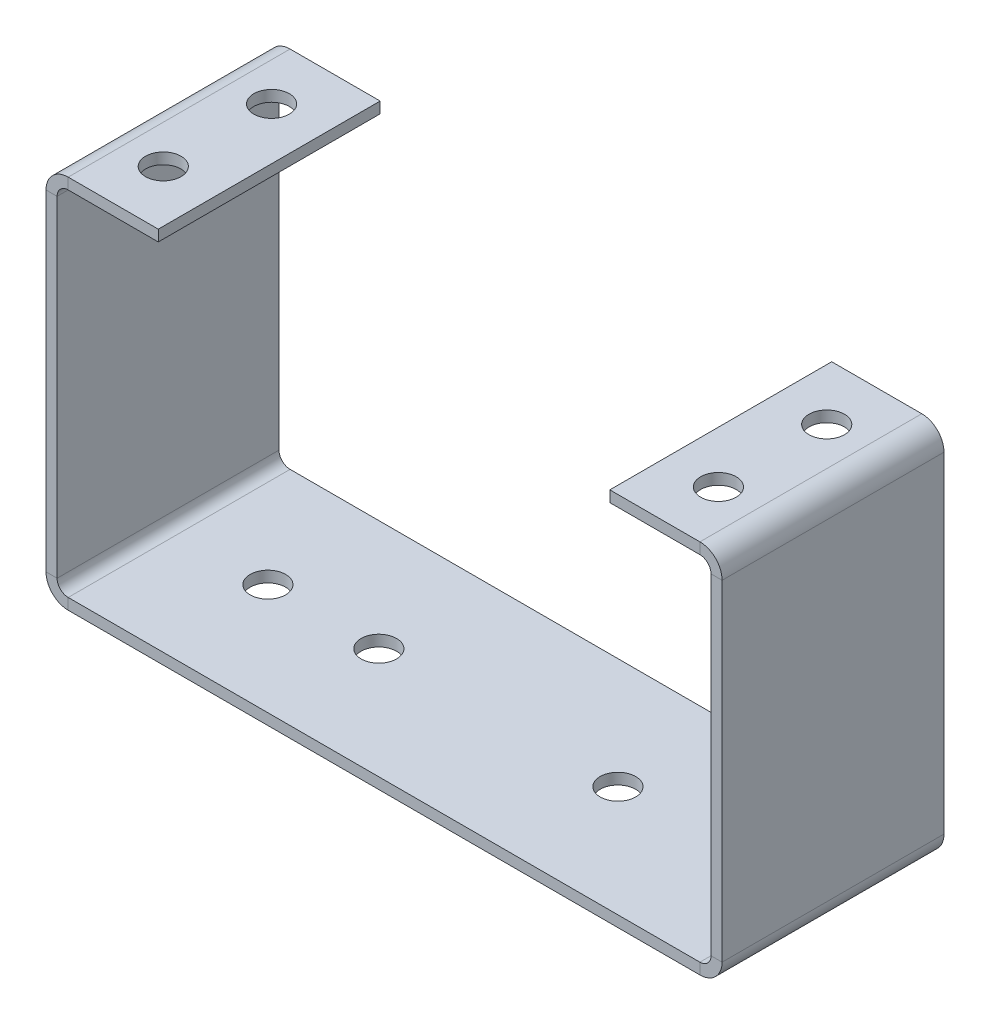
ISO-10303-21;
HEADER;
FILE_DESCRIPTION(('STEP AP214'),'2;1');
FILE_NAME('part.step','',(''),(''),'','','');
FILE_SCHEMA(('AUTOMOTIVE_DESIGN { 1 0 10303 214 1 1 1 1 }'));
ENDSEC;
DATA;
#1=APPLICATION_CONTEXT('core data for automotive mechanical design processes');
#2=APPLICATION_PROTOCOL_DEFINITION('international standard','automotive_design',2000,#1);
#3=PRODUCT_CONTEXT('',#1,'mechanical');
#4=PRODUCT('Part','Part','',(#3));
#5=PRODUCT_RELATED_PRODUCT_CATEGORY('part','',(#4));
#6=PRODUCT_DEFINITION_FORMATION('','',#4);
#7=PRODUCT_DEFINITION_CONTEXT('part definition',#1,'design');
#8=PRODUCT_DEFINITION('design','',#6,#7);
#9=PRODUCT_DEFINITION_SHAPE('','',#8);
#10=(LENGTH_UNIT() NAMED_UNIT(*) SI_UNIT(.MILLI.,.METRE.));
#11=(NAMED_UNIT(*) PLANE_ANGLE_UNIT() SI_UNIT($,.RADIAN.));
#12=(NAMED_UNIT(*) SI_UNIT($,.STERADIAN.) SOLID_ANGLE_UNIT());
#13=UNCERTAINTY_MEASURE_WITH_UNIT(LENGTH_MEASURE(1.E-05),#10,'distance_accuracy_value','');
#14=(GEOMETRIC_REPRESENTATION_CONTEXT(3) GLOBAL_UNCERTAINTY_ASSIGNED_CONTEXT((#13)) GLOBAL_UNIT_ASSIGNED_CONTEXT((#10,
#11,#12)) REPRESENTATION_CONTEXT('',''));
#15=CARTESIAN_POINT('',(0.,0.,0.));
#16=DIRECTION('',(0.,0.,1.));
#17=DIRECTION('',(1.,0.,0.));
#18=AXIS2_PLACEMENT_3D('',#15,#16,#17);
#19=CARTESIAN_POINT('',(5.44999999999998,32.81,-5.11999999999999));
#20=DIRECTION('',(0.,1.,0.));
#21=DIRECTION('',(0.,0.,1.));
#22=AXIS2_PLACEMENT_3D('',#19,#20,#21);
#23=CYLINDRICAL_SURFACE('',#22,1.6);
#24=CARTESIAN_POINT('',(5.44999999999998,32.81,-5.11999999999999));
#25=DIRECTION('',(0.,1.,0.));
#26=DIRECTION('',(0.,0.,1.));
#27=AXIS2_PLACEMENT_3D('',#24,#25,#26);
#28=CIRCLE('',#27,1.6);
#29=CARTESIAN_POINT('',(5.44999999999998,32.81,-3.52));
#30=VERTEX_POINT('',#29);
#31=EDGE_CURVE('E274',#30,#30,#28,.T.);
#32=ORIENTED_EDGE('',*,*,#31,.F.);
#33=EDGE_LOOP('',(#32));
#34=FACE_BOUND('',#33,.T.);
#35=CARTESIAN_POINT('',(5.44999999999998,33.81,-5.11999999999999));
#36=DIRECTION('',(0.,1.,0.));
#37=DIRECTION('',(0.,0.,1.));
#38=AXIS2_PLACEMENT_3D('',#35,#36,#37);
#39=CIRCLE('',#38,1.6);
#40=CARTESIAN_POINT('',(5.44999999999998,33.81,-3.52));
#41=VERTEX_POINT('',#40);
#42=EDGE_CURVE('E302',#41,#41,#39,.T.);
#43=ORIENTED_EDGE('',*,*,#42,.T.);
#44=EDGE_LOOP('',(#43));
#45=FACE_BOUND('',#44,.T.);
#46=ADVANCED_FACE('F36',(#34,#45),#23,.F.);
#47=CARTESIAN_POINT('',(5.44999999999998,32.81,-14.88));
#48=DIRECTION('',(0.,1.,0.));
#49=DIRECTION('',(0.,0.,1.));
#50=AXIS2_PLACEMENT_3D('',#47,#48,#49);
#51=CYLINDRICAL_SURFACE('',#50,1.6);
#52=CARTESIAN_POINT('',(5.44999999999998,32.81,-14.88));
#53=DIRECTION('',(0.,1.,0.));
#54=DIRECTION('',(0.,0.,1.));
#55=AXIS2_PLACEMENT_3D('',#52,#53,#54);
#56=CIRCLE('',#55,1.6);
#57=CARTESIAN_POINT('',(5.44999999999998,32.81,-13.28));
#58=VERTEX_POINT('',#57);
#59=EDGE_CURVE('E277',#58,#58,#56,.T.);
#60=ORIENTED_EDGE('',*,*,#59,.F.);
#61=EDGE_LOOP('',(#60));
#62=FACE_BOUND('',#61,.T.);
#63=CARTESIAN_POINT('',(5.44999999999998,33.81,-14.88));
#64=DIRECTION('',(0.,1.,0.));
#65=DIRECTION('',(0.,0.,1.));
#66=AXIS2_PLACEMENT_3D('',#63,#64,#65);
#67=CIRCLE('',#66,1.6);
#68=CARTESIAN_POINT('',(5.44999999999998,33.81,-13.28));
#69=VERTEX_POINT('',#68);
#70=EDGE_CURVE('E299',#69,#69,#67,.T.);
#71=ORIENTED_EDGE('',*,*,#70,.T.);
#72=EDGE_LOOP('',(#71));
#73=FACE_BOUND('',#72,.T.);
#74=ADVANCED_FACE('F463',(#62,#73),#51,.F.);
#75=CARTESIAN_POINT('',(10.12,-10.361027321573,0.));
#76=DIRECTION('',(1.,0.,0.));
#77=DIRECTION('',(0.,1.,0.));
#78=AXIS2_PLACEMENT_3D('',#75,#76,#77);
#79=PLANE('',#78);
#80=DIRECTION('',(0.,1.,0.));
#81=VECTOR('',#80,1.);
#82=CARTESIAN_POINT('',(10.12,-10.361027321573,-20.));
#83=LINE('',#82,#81);
#84=CARTESIAN_POINT('',(10.12,32.81,-20.));
#85=VERTEX_POINT('',#84);
#86=CARTESIAN_POINT('',(10.12,33.81,-20.));
#87=VERTEX_POINT('',#86);
#88=EDGE_CURVE('E296',#85,#87,#83,.T.);
#89=ORIENTED_EDGE('',*,*,#88,.T.);
#90=DIRECTION('',(0.,0.,1.));
#91=VECTOR('',#90,1.);
#92=CARTESIAN_POINT('',(10.12,33.81,0.));
#93=LINE('',#92,#91);
#94=CARTESIAN_POINT('',(10.12,33.81,0.));
#95=VERTEX_POINT('',#94);
#96=EDGE_CURVE('E293',#87,#95,#93,.T.);
#97=ORIENTED_EDGE('',*,*,#96,.T.);
#98=DIRECTION('',(0.,1.,0.));
#99=VECTOR('',#98,1.);
#100=CARTESIAN_POINT('',(10.12,-10.361027321573,0.));
#101=LINE('',#100,#99);
#102=CARTESIAN_POINT('',(10.12,32.81,0.));
#103=VERTEX_POINT('',#102);
#104=EDGE_CURVE('E280',#103,#95,#101,.T.);
#105=ORIENTED_EDGE('',*,*,#104,.F.);
#106=DIRECTION('',(0.,0.,-1.));
#107=VECTOR('',#106,1.);
#108=CARTESIAN_POINT('',(10.12,32.81,0.));
#109=LINE('',#108,#107);
#110=EDGE_CURVE('E55',#103,#85,#109,.T.);
#111=ORIENTED_EDGE('',*,*,#110,.T.);
#112=EDGE_LOOP('',(#89,#97,#105,#111));
#113=FACE_BOUND('',#112,.T.);
#114=ADVANCED_FACE('F469',(#113),#79,.T.);
#115=CARTESIAN_POINT('',(10.12,-10.361027321573,-20.));
#116=DIRECTION('',(0.,0.,-1.));
#117=DIRECTION('',(1.,0.,0.));
#118=AXIS2_PLACEMENT_3D('',#115,#116,#117);
#119=PLANE('',#118);
#120=DIRECTION('',(0.,1.,0.));
#121=VECTOR('',#120,1.);
#122=CARTESIAN_POINT('',(1.99999999999998,-10.361027321573,-20.));
#123=LINE('',#122,#121);
#124=CARTESIAN_POINT('',(1.99999999999998,32.81,-20.));
#125=VERTEX_POINT('',#124);
#126=CARTESIAN_POINT('',(1.99999999999998,33.81,-20.));
#127=VERTEX_POINT('',#126);
#128=EDGE_CURVE('E289',#125,#127,#123,.T.);
#129=ORIENTED_EDGE('',*,*,#128,.T.);
#130=DIRECTION('',(-1.,0.,0.));
#131=VECTOR('',#130,1.);
#132=CARTESIAN_POINT('',(0.,33.81,-20.));
#133=LINE('',#132,#131);
#134=EDGE_CURVE('E282',#87,#127,#133,.T.);
#135=ORIENTED_EDGE('',*,*,#134,.F.);
#136=ORIENTED_EDGE('',*,*,#88,.F.);
#137=DIRECTION('',(-1.,0.,0.));
#138=VECTOR('',#137,1.);
#139=CARTESIAN_POINT('',(10.12,32.81,-20.));
#140=LINE('',#139,#138);
#141=EDGE_CURVE('E287',#85,#125,#140,.T.);
#142=ORIENTED_EDGE('',*,*,#141,.T.);
#143=EDGE_LOOP('',(#129,#135,#136,#142));
#144=FACE_BOUND('',#143,.T.);
#145=ADVANCED_FACE('F480',(#144),#119,.T.);
#146=CARTESIAN_POINT('',(0.,33.81,0.));
#147=DIRECTION('',(0.,1.,0.));
#148=DIRECTION('',(0.,0.,1.));
#149=AXIS2_PLACEMENT_3D('',#146,#147,#148);
#150=PLANE('',#149);
#151=DIRECTION('',(0.,0.,-1.));
#152=VECTOR('',#151,1.);
#153=CARTESIAN_POINT('',(1.99999999999999,33.81,-20.));
#154=LINE('',#153,#152);
#155=CARTESIAN_POINT('',(1.99999999999999,33.81,0.));
#156=VERTEX_POINT('',#155);
#157=EDGE_CURVE('E207',#156,#127,#154,.T.);
#158=ORIENTED_EDGE('',*,*,#157,.F.);
#159=DIRECTION('',(1.,0.,0.));
#160=VECTOR('',#159,1.);
#161=CARTESIAN_POINT('',(10.12,33.81,0.));
#162=LINE('',#161,#160);
#163=EDGE_CURVE('E284',#156,#95,#162,.T.);
#164=ORIENTED_EDGE('',*,*,#163,.T.);
#165=ORIENTED_EDGE('',*,*,#96,.F.);
#166=ORIENTED_EDGE('',*,*,#134,.T.);
#167=EDGE_LOOP('',(#158,#164,#165,#166));
#168=FACE_BOUND('',#167,.T.);
#169=ORIENTED_EDGE('',*,*,#70,.F.);
#170=EDGE_LOOP('',(#169));
#171=FACE_BOUND('',#170,.T.);
#172=ORIENTED_EDGE('',*,*,#42,.F.);
#173=EDGE_LOOP('',(#172));
#174=FACE_BOUND('',#173,.T.);
#175=ADVANCED_FACE('F484',(#168,#171,#174),#150,.T.);
#176=CARTESIAN_POINT('',(10.12,-10.361027321573,0.));
#177=DIRECTION('',(0.,0.,-1.));
#178=DIRECTION('',(1.,0.,0.));
#179=AXIS2_PLACEMENT_3D('',#176,#177,#178);
#180=PLANE('',#179);
#181=ORIENTED_EDGE('',*,*,#163,.F.);
#182=DIRECTION('',(0.,1.,0.));
#183=VECTOR('',#182,1.);
#184=CARTESIAN_POINT('',(1.99999999999998,-10.361027321573,0.));
#185=LINE('',#184,#183);
#186=CARTESIAN_POINT('',(1.99999999999999,32.81,0.));
#187=VERTEX_POINT('',#186);
#188=EDGE_CURVE('E40',#187,#156,#185,.T.);
#189=ORIENTED_EDGE('',*,*,#188,.F.);
#190=DIRECTION('',(-1.,0.,0.));
#191=VECTOR('',#190,1.);
#192=CARTESIAN_POINT('',(10.12,32.81,0.));
#193=LINE('',#192,#191);
#194=EDGE_CURVE('E46',#103,#187,#193,.T.);
#195=ORIENTED_EDGE('',*,*,#194,.F.);
#196=ORIENTED_EDGE('',*,*,#104,.T.);
#197=EDGE_LOOP('',(#181,#189,#195,#196));
#198=FACE_BOUND('',#197,.T.);
#199=ADVANCED_FACE('F487',(#198),#180,.F.);
#200=CARTESIAN_POINT('',(10.12,32.81,0.));
#201=DIRECTION('',(0.,1.,0.));
#202=DIRECTION('',(0.,0.,1.));
#203=AXIS2_PLACEMENT_3D('',#200,#201,#202);
#204=PLANE('',#203);
#205=ORIENTED_EDGE('',*,*,#59,.T.);
#206=EDGE_LOOP('',(#205));
#207=FACE_BOUND('',#206,.T.);
#208=ORIENTED_EDGE('',*,*,#31,.T.);
#209=EDGE_LOOP('',(#208));
#210=FACE_BOUND('',#209,.T.);
#211=ORIENTED_EDGE('',*,*,#194,.T.);
#212=DIRECTION('',(0.,0.,-1.));
#213=VECTOR('',#212,1.);
#214=CARTESIAN_POINT('',(1.99999999999999,32.81,-20.));
#215=LINE('',#214,#213);
#216=EDGE_CURVE('E11',#187,#125,#215,.T.);
#217=ORIENTED_EDGE('',*,*,#216,.T.);
#218=ORIENTED_EDGE('',*,*,#141,.F.);
#219=ORIENTED_EDGE('',*,*,#110,.F.);
#220=EDGE_LOOP('',(#211,#217,#218,#219));
#221=FACE_BOUND('',#220,.T.);
#222=ADVANCED_FACE('F38',(#207,#210,#221),#204,.F.);
#223=CARTESIAN_POINT('',(55.49,32.81,-5.11999999999995));
#224=DIRECTION('',(0.,1.,0.));
#225=DIRECTION('',(0.,0.,1.));
#226=AXIS2_PLACEMENT_3D('',#223,#224,#225);
#227=CYLINDRICAL_SURFACE('',#226,1.6);
#228=CARTESIAN_POINT('',(55.49,32.81,-5.11999999999995));
#229=DIRECTION('',(0.,1.,0.));
#230=DIRECTION('',(0.,0.,1.));
#231=AXIS2_PLACEMENT_3D('',#228,#229,#230);
#232=CIRCLE('',#231,1.6);
#233=CARTESIAN_POINT('',(55.49,32.81,-3.51999999999996));
#234=VERTEX_POINT('',#233);
#235=EDGE_CURVE('E238',#234,#234,#232,.T.);
#236=ORIENTED_EDGE('',*,*,#235,.F.);
#237=EDGE_LOOP('',(#236));
#238=FACE_BOUND('',#237,.T.);
#239=CARTESIAN_POINT('',(55.49,33.81,-5.11999999999995));
#240=DIRECTION('',(0.,1.,0.));
#241=DIRECTION('',(0.,0.,1.));
#242=AXIS2_PLACEMENT_3D('',#239,#240,#241);
#243=CIRCLE('',#242,1.6);
#244=CARTESIAN_POINT('',(55.49,33.81,-3.51999999999996));
#245=VERTEX_POINT('',#244);
#246=EDGE_CURVE('E266',#245,#245,#243,.T.);
#247=ORIENTED_EDGE('',*,*,#246,.T.);
#248=EDGE_LOOP('',(#247));
#249=FACE_BOUND('',#248,.T.);
#250=ADVANCED_FACE('F493',(#238,#249),#227,.F.);
#251=CARTESIAN_POINT('',(55.49,32.81,-14.88));
#252=DIRECTION('',(0.,1.,0.));
#253=DIRECTION('',(0.,0.,1.));
#254=AXIS2_PLACEMENT_3D('',#251,#252,#253);
#255=CYLINDRICAL_SURFACE('',#254,1.6);
#256=CARTESIAN_POINT('',(55.49,32.81,-14.88));
#257=DIRECTION('',(0.,1.,0.));
#258=DIRECTION('',(0.,0.,1.));
#259=AXIS2_PLACEMENT_3D('',#256,#257,#258);
#260=CIRCLE('',#259,1.6);
#261=CARTESIAN_POINT('',(55.49,32.81,-13.28));
#262=VERTEX_POINT('',#261);
#263=EDGE_CURVE('E241',#262,#262,#260,.T.);
#264=ORIENTED_EDGE('',*,*,#263,.F.);
#265=EDGE_LOOP('',(#264));
#266=FACE_BOUND('',#265,.T.);
#267=CARTESIAN_POINT('',(55.49,33.81,-14.88));
#268=DIRECTION('',(0.,1.,0.));
#269=DIRECTION('',(0.,0.,1.));
#270=AXIS2_PLACEMENT_3D('',#267,#268,#269);
#271=CIRCLE('',#270,1.6);
#272=CARTESIAN_POINT('',(55.49,33.81,-13.28));
#273=VERTEX_POINT('',#272);
#274=EDGE_CURVE('E263',#273,#273,#271,.T.);
#275=ORIENTED_EDGE('',*,*,#274,.T.);
#276=EDGE_LOOP('',(#275));
#277=FACE_BOUND('',#276,.T.);
#278=ADVANCED_FACE('F506',(#266,#277),#255,.F.);
#279=CARTESIAN_POINT('',(50.82,-10.361027321573,-20.));
#280=DIRECTION('',(-1.,0.,0.));
#281=DIRECTION('',(0.,-1.,0.));
#282=AXIS2_PLACEMENT_3D('',#279,#280,#281);
#283=PLANE('',#282);
#284=DIRECTION('',(0.,0.,-1.));
#285=VECTOR('',#284,1.);
#286=CARTESIAN_POINT('',(50.82,33.81,-20.));
#287=LINE('',#286,#285);
#288=CARTESIAN_POINT('',(50.82,33.81,0.));
#289=VERTEX_POINT('',#288);
#290=CARTESIAN_POINT('',(50.82,33.81,-20.));
#291=VERTEX_POINT('',#290);
#292=EDGE_CURVE('E97',#289,#291,#287,.T.);
#293=ORIENTED_EDGE('',*,*,#292,.T.);
#294=DIRECTION('',(0.,1.,0.));
#295=VECTOR('',#294,1.);
#296=CARTESIAN_POINT('',(50.82,-10.361027321573,-20.));
#297=LINE('',#296,#295);
#298=CARTESIAN_POINT('',(50.82,32.81,-20.));
#299=VERTEX_POINT('',#298);
#300=EDGE_CURVE('E245',#299,#291,#297,.T.);
#301=ORIENTED_EDGE('',*,*,#300,.F.);
#302=DIRECTION('',(0.,0.,1.));
#303=VECTOR('',#302,1.);
#304=CARTESIAN_POINT('',(50.82,32.81,-20.));
#305=LINE('',#304,#303);
#306=CARTESIAN_POINT('',(50.82,32.81,0.));
#307=VERTEX_POINT('',#306);
#308=EDGE_CURVE('E82',#299,#307,#305,.T.);
#309=ORIENTED_EDGE('',*,*,#308,.T.);
#310=DIRECTION('',(0.,1.,0.));
#311=VECTOR('',#310,1.);
#312=CARTESIAN_POINT('',(50.82,-10.361027321573,0.));
#313=LINE('',#312,#311);
#314=EDGE_CURVE('E258',#307,#289,#313,.T.);
#315=ORIENTED_EDGE('',*,*,#314,.T.);
#316=EDGE_LOOP('',(#293,#301,#309,#315));
#317=FACE_BOUND('',#316,.T.);
#318=ADVANCED_FACE('F514',(#317),#283,.T.);
#319=CARTESIAN_POINT('',(50.82,-10.361027321573,0.));
#320=DIRECTION('',(0.,0.,1.));
#321=DIRECTION('',(-1.,0.,0.));
#322=AXIS2_PLACEMENT_3D('',#319,#320,#321);
#323=PLANE('',#322);
#324=DIRECTION('',(1.,0.,0.));
#325=VECTOR('',#324,1.);
#326=CARTESIAN_POINT('',(60.94,33.81,0.));
#327=LINE('',#326,#325);
#328=CARTESIAN_POINT('',(58.94,33.81,0.));
#329=VERTEX_POINT('',#328);
#330=EDGE_CURVE('E250',#289,#329,#327,.T.);
#331=ORIENTED_EDGE('',*,*,#330,.F.);
#332=ORIENTED_EDGE('',*,*,#314,.F.);
#333=DIRECTION('',(1.,0.,0.));
#334=VECTOR('',#333,1.);
#335=CARTESIAN_POINT('',(50.82,32.81,0.));
#336=LINE('',#335,#334);
#337=CARTESIAN_POINT('',(58.94,32.81,0.));
#338=VERTEX_POINT('',#337);
#339=EDGE_CURVE('E255',#307,#338,#336,.T.);
#340=ORIENTED_EDGE('',*,*,#339,.T.);
#341=DIRECTION('',(0.,1.,0.));
#342=VECTOR('',#341,1.);
#343=CARTESIAN_POINT('',(58.94,-10.361027321573,0.));
#344=LINE('',#343,#342);
#345=EDGE_CURVE('E252',#338,#329,#344,.T.);
#346=ORIENTED_EDGE('',*,*,#345,.T.);
#347=EDGE_LOOP('',(#331,#332,#340,#346));
#348=FACE_BOUND('',#347,.T.);
#349=ADVANCED_FACE('F524',(#348),#323,.T.);
#350=CARTESIAN_POINT('',(0.,33.81,0.));
#351=DIRECTION('',(0.,-1.,0.));
#352=DIRECTION('',(0.,0.,-1.));
#353=AXIS2_PLACEMENT_3D('',#350,#351,#352);
#354=PLANE('',#353);
#355=ORIENTED_EDGE('',*,*,#274,.F.);
#356=EDGE_LOOP('',(#355));
#357=FACE_BOUND('',#356,.T.);
#358=ORIENTED_EDGE('',*,*,#246,.F.);
#359=EDGE_LOOP('',(#358));
#360=FACE_BOUND('',#359,.T.);
#361=ORIENTED_EDGE('',*,*,#330,.T.);
#362=DIRECTION('',(0.,0.,-1.));
#363=VECTOR('',#362,1.);
#364=CARTESIAN_POINT('',(58.94,33.81,0.));
#365=LINE('',#364,#363);
#366=CARTESIAN_POINT('',(58.94,33.81,-20.));
#367=VERTEX_POINT('',#366);
#368=EDGE_CURVE('E248',#329,#367,#365,.T.);
#369=ORIENTED_EDGE('',*,*,#368,.T.);
#370=DIRECTION('',(1.,0.,0.));
#371=VECTOR('',#370,1.);
#372=CARTESIAN_POINT('',(50.82,33.81,-20.));
#373=LINE('',#372,#371);
#374=EDGE_CURVE('E102',#291,#367,#373,.T.);
#375=ORIENTED_EDGE('',*,*,#374,.F.);
#376=ORIENTED_EDGE('',*,*,#292,.F.);
#377=EDGE_LOOP('',(#361,#369,#375,#376));
#378=FACE_BOUND('',#377,.T.);
#379=ADVANCED_FACE('F528',(#357,#360,#378),#354,.F.);
#380=CARTESIAN_POINT('',(50.82,-10.361027321573,-20.));
#381=DIRECTION('',(0.,0.,1.));
#382=DIRECTION('',(-1.,0.,0.));
#383=AXIS2_PLACEMENT_3D('',#380,#381,#382);
#384=PLANE('',#383);
#385=ORIENTED_EDGE('',*,*,#300,.T.);
#386=ORIENTED_EDGE('',*,*,#374,.T.);
#387=DIRECTION('',(0.,1.,0.));
#388=VECTOR('',#387,1.);
#389=CARTESIAN_POINT('',(58.94,-10.361027321573,-20.));
#390=LINE('',#389,#388);
#391=CARTESIAN_POINT('',(58.94,32.81,-20.));
#392=VERTEX_POINT('',#391);
#393=EDGE_CURVE('E269',#392,#367,#390,.T.);
#394=ORIENTED_EDGE('',*,*,#393,.F.);
#395=DIRECTION('',(1.,0.,0.));
#396=VECTOR('',#395,1.);
#397=CARTESIAN_POINT('',(50.82,32.81,-20.));
#398=LINE('',#397,#396);
#399=EDGE_CURVE('E236',#299,#392,#398,.T.);
#400=ORIENTED_EDGE('',*,*,#399,.F.);
#401=EDGE_LOOP('',(#385,#386,#394,#400));
#402=FACE_BOUND('',#401,.T.);
#403=ADVANCED_FACE('F531',(#402),#384,.F.);
#404=CARTESIAN_POINT('',(50.82,32.81,-20.));
#405=DIRECTION('',(0.,1.,0.));
#406=DIRECTION('',(0.,0.,1.));
#407=AXIS2_PLACEMENT_3D('',#404,#405,#406);
#408=PLANE('',#407);
#409=ORIENTED_EDGE('',*,*,#263,.T.);
#410=EDGE_LOOP('',(#409));
#411=FACE_BOUND('',#410,.T.);
#412=ORIENTED_EDGE('',*,*,#235,.T.);
#413=EDGE_LOOP('',(#412));
#414=FACE_BOUND('',#413,.T.);
#415=ORIENTED_EDGE('',*,*,#399,.T.);
#416=DIRECTION('',(0.,0.,1.));
#417=VECTOR('',#416,1.);
#418=CARTESIAN_POINT('',(58.94,32.81,0.));
#419=LINE('',#418,#417);
#420=EDGE_CURVE('E233',#392,#338,#419,.T.);
#421=ORIENTED_EDGE('',*,*,#420,.T.);
#422=ORIENTED_EDGE('',*,*,#339,.F.);
#423=ORIENTED_EDGE('',*,*,#308,.F.);
#424=EDGE_LOOP('',(#415,#421,#422,#423));
#425=FACE_BOUND('',#424,.T.);
#426=ADVANCED_FACE('F475',(#411,#414,#425),#408,.F.);
#427=CARTESIAN_POINT('',(72.7951558254455,33.81,-20.));
#428=DIRECTION('',(0.,0.,-1.));
#429=DIRECTION('',(0.,1.,0.));
#430=AXIS2_PLACEMENT_3D('',#427,#428,#429);
#431=PLANE('',#430);
#432=DIRECTION('',(0.,-1.,0.));
#433=VECTOR('',#432,1.);
#434=CARTESIAN_POINT('',(0.,1.,-20.));
#435=LINE('',#434,#433);
#436=CARTESIAN_POINT('',(0.,31.81,-20.));
#437=VERTEX_POINT('',#436);
#438=CARTESIAN_POINT('',(0.,2.00000000000001,-20.));
#439=VERTEX_POINT('',#438);
#440=EDGE_CURVE('E213',#437,#439,#435,.T.);
#441=ORIENTED_EDGE('',*,*,#440,.F.);
#442=DIRECTION('',(-1.,0.,0.));
#443=VECTOR('',#442,1.);
#444=CARTESIAN_POINT('',(72.7951558254455,31.81,-20.));
#445=LINE('',#444,#443);
#446=CARTESIAN_POINT('',(0.99999999999999,31.81,-20.));
#447=VERTEX_POINT('',#446);
#448=EDGE_CURVE('E192',#447,#437,#445,.T.);
#449=ORIENTED_EDGE('',*,*,#448,.F.);
#450=DIRECTION('',(0.,-1.,0.));
#451=VECTOR('',#450,1.);
#452=CARTESIAN_POINT('',(0.999999999999998,33.81,-20.));
#453=LINE('',#452,#451);
#454=CARTESIAN_POINT('',(0.999999999999998,2.,-20.));
#455=VERTEX_POINT('',#454);
#456=EDGE_CURVE('E202',#447,#455,#453,.T.);
#457=ORIENTED_EDGE('',*,*,#456,.T.);
#458=DIRECTION('',(-1.,0.,0.));
#459=VECTOR('',#458,1.);
#460=CARTESIAN_POINT('',(72.7951558254455,2.,-20.));
#461=LINE('',#460,#459);
#462=EDGE_CURVE('E215',#455,#439,#461,.T.);
#463=ORIENTED_EDGE('',*,*,#462,.T.);
#464=EDGE_LOOP('',(#441,#449,#457,#463));
#465=FACE_BOUND('',#464,.T.);
#466=ADVANCED_FACE('F214',(#465),#431,.T.);
#467=CARTESIAN_POINT('',(0.,1.,0.));
#468=DIRECTION('',(1.,0.,0.));
#469=DIRECTION('',(0.,0.,-1.));
#470=AXIS2_PLACEMENT_3D('',#467,#468,#469);
#471=PLANE('',#470);
#472=DIRECTION('',(0.,0.,1.));
#473=VECTOR('',#472,1.);
#474=CARTESIAN_POINT('',(0.,31.81,-20.));
#475=LINE('',#474,#473);
#476=CARTESIAN_POINT('',(0.,31.81,0.));
#477=VERTEX_POINT('',#476);
#478=EDGE_CURVE('E108',#437,#477,#475,.T.);
#479=ORIENTED_EDGE('',*,*,#478,.F.);
#480=ORIENTED_EDGE('',*,*,#440,.T.);
#481=DIRECTION('',(0.,0.,1.));
#482=VECTOR('',#481,1.);
#483=CARTESIAN_POINT('',(0.,2.,-20.));
#484=LINE('',#483,#482);
#485=CARTESIAN_POINT('',(0.,2.,0.));
#486=VERTEX_POINT('',#485);
#487=EDGE_CURVE('E218',#439,#486,#484,.T.);
#488=ORIENTED_EDGE('',*,*,#487,.T.);
#489=DIRECTION('',(0.,-1.,0.));
#490=VECTOR('',#489,1.);
#491=CARTESIAN_POINT('',(0.,1.,0.));
#492=LINE('',#491,#490);
#493=EDGE_CURVE('E223',#477,#486,#492,.T.);
#494=ORIENTED_EDGE('',*,*,#493,.F.);
#495=EDGE_LOOP('',(#479,#480,#488,#494));
#496=FACE_BOUND('',#495,.T.);
#497=ADVANCED_FACE('F221',(#496),#471,.F.);
#498=CARTESIAN_POINT('',(72.7951558254455,33.81,0.));
#499=DIRECTION('',(0.,0.,-1.));
#500=DIRECTION('',(0.,1.,0.));
#501=AXIS2_PLACEMENT_3D('',#498,#499,#500);
#502=PLANE('',#501);
#503=DIRECTION('',(-1.,0.,0.));
#504=VECTOR('',#503,1.);
#505=CARTESIAN_POINT('',(72.7951558254455,31.81,0.));
#506=LINE('',#505,#504);
#507=CARTESIAN_POINT('',(0.999999999999991,31.81,0.));
#508=VERTEX_POINT('',#507);
#509=EDGE_CURVE('E434',#508,#477,#506,.T.);
#510=ORIENTED_EDGE('',*,*,#509,.T.);
#511=ORIENTED_EDGE('',*,*,#493,.T.);
#512=DIRECTION('',(-1.,0.,0.));
#513=VECTOR('',#512,1.);
#514=CARTESIAN_POINT('',(72.7951558254455,2.,0.));
#515=LINE('',#514,#513);
#516=CARTESIAN_POINT('',(0.999999999999999,2.,0.));
#517=VERTEX_POINT('',#516);
#518=EDGE_CURVE('E226',#517,#486,#515,.T.);
#519=ORIENTED_EDGE('',*,*,#518,.F.);
#520=DIRECTION('',(0.,-1.,0.));
#521=VECTOR('',#520,1.);
#522=CARTESIAN_POINT('',(1.,33.81,0.));
#523=LINE('',#522,#521);
#524=EDGE_CURVE('E430',#508,#517,#523,.T.);
#525=ORIENTED_EDGE('',*,*,#524,.F.);
#526=EDGE_LOOP('',(#510,#511,#519,#525));
#527=FACE_BOUND('',#526,.T.);
#528=ADVANCED_FACE('F452',(#527),#502,.F.);
#529=CARTESIAN_POINT('',(0.999999999999998,33.81,-20.));
#530=DIRECTION('',(-1.,0.,0.));
#531=DIRECTION('',(0.,0.,1.));
#532=AXIS2_PLACEMENT_3D('',#529,#530,#531);
#533=PLANE('',#532);
#534=DIRECTION('',(0.,0.,-1.));
#535=VECTOR('',#534,1.);
#536=CARTESIAN_POINT('',(0.999999999999996,31.81,-20.));
#537=LINE('',#536,#535);
#538=EDGE_CURVE('E224',#508,#447,#537,.T.);
#539=ORIENTED_EDGE('',*,*,#538,.F.);
#540=ORIENTED_EDGE('',*,*,#524,.T.);
#541=DIRECTION('',(0.,0.,-1.));
#542=VECTOR('',#541,1.);
#543=CARTESIAN_POINT('',(0.999999999999998,2.,-20.));
#544=LINE('',#543,#542);
#545=EDGE_CURVE('E271',#517,#455,#544,.T.);
#546=ORIENTED_EDGE('',*,*,#545,.T.);
#547=ORIENTED_EDGE('',*,*,#456,.F.);
#548=EDGE_LOOP('',(#539,#540,#546,#547));
#549=FACE_BOUND('',#548,.T.);
#550=ADVANCED_FACE('F440',(#549),#533,.F.);
#551=CARTESIAN_POINT('',(-11.8551558254455,33.81,0.));
#552=DIRECTION('',(0.,0.,1.));
#553=DIRECTION('',(0.,1.,0.));
#554=AXIS2_PLACEMENT_3D('',#551,#552,#553);
#555=PLANE('',#554);
#556=DIRECTION('',(0.,-1.,0.));
#557=VECTOR('',#556,1.);
#558=CARTESIAN_POINT('',(60.94,0.999999999999966,0.));
#559=LINE('',#558,#557);
#560=CARTESIAN_POINT('',(60.94,31.81,0.));
#561=VERTEX_POINT('',#560);
#562=CARTESIAN_POINT('',(60.94,2.,0.));
#563=VERTEX_POINT('',#562);
#564=EDGE_CURVE('E408',#561,#563,#559,.T.);
#565=ORIENTED_EDGE('',*,*,#564,.F.);
#566=DIRECTION('',(1.,0.,0.));
#567=VECTOR('',#566,1.);
#568=CARTESIAN_POINT('',(-11.8551558254455,31.81,0.));
#569=LINE('',#568,#567);
#570=CARTESIAN_POINT('',(59.94,31.81,0.));
#571=VERTEX_POINT('',#570);
#572=EDGE_CURVE('E417',#571,#561,#569,.T.);
#573=ORIENTED_EDGE('',*,*,#572,.F.);
#574=DIRECTION('',(0.,-1.,0.));
#575=VECTOR('',#574,1.);
#576=CARTESIAN_POINT('',(59.94,33.81,0.));
#577=LINE('',#576,#575);
#578=CARTESIAN_POINT('',(59.94,1.99999999999999,0.));
#579=VERTEX_POINT('',#578);
#580=EDGE_CURVE('E414',#571,#579,#577,.T.);
#581=ORIENTED_EDGE('',*,*,#580,.T.);
#582=DIRECTION('',(1.,0.,0.));
#583=VECTOR('',#582,1.);
#584=CARTESIAN_POINT('',(-11.8551558254455,1.99999999999999,0.));
#585=LINE('',#584,#583);
#586=EDGE_CURVE('E411',#579,#563,#585,.T.);
#587=ORIENTED_EDGE('',*,*,#586,.T.);
#588=EDGE_LOOP('',(#565,#573,#581,#587));
#589=FACE_BOUND('',#588,.T.);
#590=ADVANCED_FACE('F552',(#589),#555,.T.);
#591=CARTESIAN_POINT('',(60.94,0.999999999999966,0.));
#592=DIRECTION('',(-1.,0.,0.));
#593=DIRECTION('',(0.,0.,1.));
#594=AXIS2_PLACEMENT_3D('',#591,#592,#593);
#595=PLANE('',#594);
#596=DIRECTION('',(0.,0.,-1.));
#597=VECTOR('',#596,1.);
#598=CARTESIAN_POINT('',(60.94,31.81,0.));
#599=LINE('',#598,#597);
#600=CARTESIAN_POINT('',(60.94,31.81,-20.));
#601=VERTEX_POINT('',#600);
#602=EDGE_CURVE('E421',#561,#601,#599,.T.);
#603=ORIENTED_EDGE('',*,*,#602,.F.);
#604=ORIENTED_EDGE('',*,*,#564,.T.);
#605=DIRECTION('',(0.,0.,-1.));
#606=VECTOR('',#605,1.);
#607=CARTESIAN_POINT('',(60.94,1.99999999999999,0.));
#608=LINE('',#607,#606);
#609=CARTESIAN_POINT('',(60.94,2.,-20.));
#610=VERTEX_POINT('',#609);
#611=EDGE_CURVE('E405',#563,#610,#608,.T.);
#612=ORIENTED_EDGE('',*,*,#611,.T.);
#613=DIRECTION('',(0.,-1.,0.));
#614=VECTOR('',#613,1.);
#615=CARTESIAN_POINT('',(60.94,0.999999999999994,-20.));
#616=LINE('',#615,#614);
#617=EDGE_CURVE('E397',#601,#610,#616,.T.);
#618=ORIENTED_EDGE('',*,*,#617,.F.);
#619=EDGE_LOOP('',(#603,#604,#612,#618));
#620=FACE_BOUND('',#619,.T.);
#621=ADVANCED_FACE('F557',(#620),#595,.F.);
#622=CARTESIAN_POINT('',(-11.8551558254455,33.81,-20.));
#623=DIRECTION('',(0.,0.,1.));
#624=DIRECTION('',(0.,1.,0.));
#625=AXIS2_PLACEMENT_3D('',#622,#623,#624);
#626=PLANE('',#625);
#627=DIRECTION('',(1.,0.,0.));
#628=VECTOR('',#627,1.);
#629=CARTESIAN_POINT('',(-11.8551558254455,31.81,-20.));
#630=LINE('',#629,#628);
#631=CARTESIAN_POINT('',(59.94,31.81,-20.));
#632=VERTEX_POINT('',#631);
#633=EDGE_CURVE('E402',#632,#601,#630,.T.);
#634=ORIENTED_EDGE('',*,*,#633,.T.);
#635=ORIENTED_EDGE('',*,*,#617,.T.);
#636=DIRECTION('',(1.,0.,0.));
#637=VECTOR('',#636,1.);
#638=CARTESIAN_POINT('',(-11.8551558254455,2.00000000000001,-20.));
#639=LINE('',#638,#637);
#640=CARTESIAN_POINT('',(59.94,2.00000000000001,-20.));
#641=VERTEX_POINT('',#640);
#642=EDGE_CURVE('E391',#641,#610,#639,.T.);
#643=ORIENTED_EDGE('',*,*,#642,.F.);
#644=DIRECTION('',(0.,-1.,0.));
#645=VECTOR('',#644,1.);
#646=CARTESIAN_POINT('',(59.94,33.81,-20.));
#647=LINE('',#646,#645);
#648=EDGE_CURVE('E394',#632,#641,#647,.T.);
#649=ORIENTED_EDGE('',*,*,#648,.F.);
#650=EDGE_LOOP('',(#634,#635,#643,#649));
#651=FACE_BOUND('',#650,.T.);
#652=ADVANCED_FACE('F563',(#651),#626,.F.);
#653=CARTESIAN_POINT('',(59.94,33.81,-20.));
#654=DIRECTION('',(1.,0.,0.));
#655=DIRECTION('',(0.,0.,-1.));
#656=AXIS2_PLACEMENT_3D('',#653,#654,#655);
#657=PLANE('',#656);
#658=DIRECTION('',(0.,0.,1.));
#659=VECTOR('',#658,1.);
#660=CARTESIAN_POINT('',(59.94,31.81,0.));
#661=LINE('',#660,#659);
#662=EDGE_CURVE('E423',#632,#571,#661,.T.);
#663=ORIENTED_EDGE('',*,*,#662,.F.);
#664=ORIENTED_EDGE('',*,*,#648,.T.);
#665=DIRECTION('',(0.,0.,1.));
#666=VECTOR('',#665,1.);
#667=CARTESIAN_POINT('',(59.94,1.99999999999999,0.));
#668=LINE('',#667,#666);
#669=EDGE_CURVE('E232',#641,#579,#668,.T.);
#670=ORIENTED_EDGE('',*,*,#669,.T.);
#671=ORIENTED_EDGE('',*,*,#580,.F.);
#672=EDGE_LOOP('',(#663,#664,#670,#671));
#673=FACE_BOUND('',#672,.T.);
#674=ADVANCED_FACE('F567',(#673),#657,.F.);
#675=CARTESIAN_POINT('',(0.,0.,0.));
#676=DIRECTION('',(0.,-1.,0.));
#677=DIRECTION('',(0.,0.,-1.));
#678=AXIS2_PLACEMENT_3D('',#675,#676,#677);
#679=PLANE('',#678);
#680=CARTESIAN_POINT('',(20.,0.,-10.));
#681=DIRECTION('',(0.,-1.,0.));
#682=DIRECTION('',(0.,0.,-1.));
#683=AXIS2_PLACEMENT_3D('',#680,#681,#682);
#684=CIRCLE('',#683,1.6);
#685=CARTESIAN_POINT('',(20.,0.,-11.6));
#686=VERTEX_POINT('',#685);
#687=EDGE_CURVE('E368',#686,#686,#684,.T.);
#688=ORIENTED_EDGE('',*,*,#687,.F.);
#689=EDGE_LOOP('',(#688));
#690=FACE_BOUND('',#689,.T.);
#691=CARTESIAN_POINT('',(10.,0.,-10.));
#692=DIRECTION('',(0.,-1.,0.));
#693=DIRECTION('',(0.,0.,-1.));
#694=AXIS2_PLACEMENT_3D('',#691,#692,#693);
#695=CIRCLE('',#694,1.6);
#696=CARTESIAN_POINT('',(10.,0.,-11.6));
#697=VERTEX_POINT('',#696);
#698=EDGE_CURVE('E1140',#697,#697,#695,.T.);
#699=ORIENTED_EDGE('',*,*,#698,.F.);
#700=EDGE_LOOP('',(#699));
#701=FACE_BOUND('',#700,.T.);
#702=CARTESIAN_POINT('',(41.55,0.,-10.));
#703=DIRECTION('',(0.,-1.,0.));
#704=DIRECTION('',(0.,0.,-1.));
#705=AXIS2_PLACEMENT_3D('',#702,#703,#704);
#706=CIRCLE('',#705,1.6);
#707=CARTESIAN_POINT('',(41.55,0.,-11.6));
#708=VERTEX_POINT('',#707);
#709=EDGE_CURVE('E1137',#708,#708,#706,.T.);
#710=ORIENTED_EDGE('',*,*,#709,.F.);
#711=EDGE_LOOP('',(#710));
#712=FACE_BOUND('',#711,.T.);
#713=DIRECTION('',(1.,0.,0.));
#714=VECTOR('',#713,1.);
#715=CARTESIAN_POINT('',(0.,0.,0.));
#716=LINE('',#715,#714);
#717=CARTESIAN_POINT('',(2.,0.,0.));
#718=VERTEX_POINT('',#717);
#719=CARTESIAN_POINT('',(58.94,0.,0.));
#720=VERTEX_POINT('',#719);
#721=EDGE_CURVE('E364',#718,#720,#716,.T.);
#722=ORIENTED_EDGE('',*,*,#721,.F.);
#723=DIRECTION('',(0.,0.,-1.));
#724=VECTOR('',#723,1.);
#725=CARTESIAN_POINT('',(2.,0.,-20.));
#726=LINE('',#725,#724);
#727=CARTESIAN_POINT('',(2.,0.,-20.));
#728=VERTEX_POINT('',#727);
#729=EDGE_CURVE('E372',#718,#728,#726,.T.);
#730=ORIENTED_EDGE('',*,*,#729,.T.);
#731=DIRECTION('',(-1.,0.,0.));
#732=VECTOR('',#731,1.);
#733=CARTESIAN_POINT('',(0.,0.,-20.));
#734=LINE('',#733,#732);
#735=CARTESIAN_POINT('',(58.9399999999999,0.,-20.));
#736=VERTEX_POINT('',#735);
#737=EDGE_CURVE('E1134',#736,#728,#734,.T.);
#738=ORIENTED_EDGE('',*,*,#737,.F.);
#739=DIRECTION('',(0.,0.,1.));
#740=VECTOR('',#739,1.);
#741=CARTESIAN_POINT('',(58.94,0.,0.));
#742=LINE('',#741,#740);
#743=EDGE_CURVE('E388',#736,#720,#742,.T.);
#744=ORIENTED_EDGE('',*,*,#743,.T.);
#745=EDGE_LOOP('',(#722,#730,#738,#744));
#746=FACE_BOUND('',#745,.T.);
#747=ADVANCED_FACE('F616',(#690,#701,#712,#746),#679,.T.);
#748=CARTESIAN_POINT('',(0.,1.,0.));
#749=DIRECTION('',(0.,-1.,0.));
#750=DIRECTION('',(0.,0.,-1.));
#751=AXIS2_PLACEMENT_3D('',#748,#749,#750);
#752=PLANE('',#751);
#753=CARTESIAN_POINT('',(20.,1.,-10.));
#754=DIRECTION('',(0.,-1.,0.));
#755=DIRECTION('',(0.,0.,-1.));
#756=AXIS2_PLACEMENT_3D('',#753,#754,#755);
#757=CIRCLE('',#756,1.6);
#758=CARTESIAN_POINT('',(20.,1.,-11.6));
#759=VERTEX_POINT('',#758);
#760=EDGE_CURVE('E342',#759,#759,#757,.T.);
#761=ORIENTED_EDGE('',*,*,#760,.T.);
#762=EDGE_LOOP('',(#761));
#763=FACE_BOUND('',#762,.T.);
#764=CARTESIAN_POINT('',(10.,1.,-10.));
#765=DIRECTION('',(0.,-1.,0.));
#766=DIRECTION('',(0.,0.,-1.));
#767=AXIS2_PLACEMENT_3D('',#764,#765,#766);
#768=CIRCLE('',#767,1.6);
#769=CARTESIAN_POINT('',(10.,1.,-11.6));
#770=VERTEX_POINT('',#769);
#771=EDGE_CURVE('E348',#770,#770,#768,.T.);
#772=ORIENTED_EDGE('',*,*,#771,.T.);
#773=EDGE_LOOP('',(#772));
#774=FACE_BOUND('',#773,.T.);
#775=CARTESIAN_POINT('',(41.55,1.,-10.));
#776=DIRECTION('',(0.,-1.,0.));
#777=DIRECTION('',(0.,0.,-1.));
#778=AXIS2_PLACEMENT_3D('',#775,#776,#777);
#779=CIRCLE('',#778,1.6);
#780=CARTESIAN_POINT('',(41.55,1.,-11.6));
#781=VERTEX_POINT('',#780);
#782=EDGE_CURVE('E351',#781,#781,#779,.T.);
#783=ORIENTED_EDGE('',*,*,#782,.T.);
#784=EDGE_LOOP('',(#783));
#785=FACE_BOUND('',#784,.T.);
#786=DIRECTION('',(0.,0.,-1.));
#787=VECTOR('',#786,1.);
#788=CARTESIAN_POINT('',(2.,1.,-20.));
#789=LINE('',#788,#787);
#790=CARTESIAN_POINT('',(2.,1.,0.));
#791=VERTEX_POINT('',#790);
#792=CARTESIAN_POINT('',(2.,1.,-20.));
#793=VERTEX_POINT('',#792);
#794=EDGE_CURVE('E369',#791,#793,#789,.T.);
#795=ORIENTED_EDGE('',*,*,#794,.F.);
#796=DIRECTION('',(1.,0.,0.));
#797=VECTOR('',#796,1.);
#798=CARTESIAN_POINT('',(0.,1.,0.));
#799=LINE('',#798,#797);
#800=CARTESIAN_POINT('',(58.94,0.999999999999988,0.));
#801=VERTEX_POINT('',#800);
#802=EDGE_CURVE('E354',#791,#801,#799,.T.);
#803=ORIENTED_EDGE('',*,*,#802,.T.);
#804=DIRECTION('',(0.,0.,1.));
#805=VECTOR('',#804,1.);
#806=CARTESIAN_POINT('',(58.94,1.,0.));
#807=LINE('',#806,#805);
#808=CARTESIAN_POINT('',(58.94,1.,-20.));
#809=VERTEX_POINT('',#808);
#810=EDGE_CURVE('E385',#809,#801,#807,.T.);
#811=ORIENTED_EDGE('',*,*,#810,.F.);
#812=DIRECTION('',(-1.,0.,0.));
#813=VECTOR('',#812,1.);
#814=CARTESIAN_POINT('',(0.,1.,-20.));
#815=LINE('',#814,#813);
#816=EDGE_CURVE('E363',#809,#793,#815,.T.);
#817=ORIENTED_EDGE('',*,*,#816,.T.);
#818=EDGE_LOOP('',(#795,#803,#811,#817));
#819=FACE_BOUND('',#818,.T.);
#820=ADVANCED_FACE('F612',(#763,#774,#785,#819),#752,.F.);
#821=CARTESIAN_POINT('',(41.55,1.,-10.));
#822=DIRECTION('',(0.,-1.,0.));
#823=DIRECTION('',(0.,0.,-1.));
#824=AXIS2_PLACEMENT_3D('',#821,#822,#823);
#825=CYLINDRICAL_SURFACE('',#824,1.6);
#826=ORIENTED_EDGE('',*,*,#782,.F.);
#827=EDGE_LOOP('',(#826));
#828=FACE_BOUND('',#827,.T.);
#829=ORIENTED_EDGE('',*,*,#709,.T.);
#830=EDGE_LOOP('',(#829));
#831=FACE_BOUND('',#830,.T.);
#832=ADVANCED_FACE('F615',(#828,#831),#825,.F.);
#833=CARTESIAN_POINT('',(10.,1.,-10.));
#834=DIRECTION('',(0.,-1.,0.));
#835=DIRECTION('',(0.,0.,-1.));
#836=AXIS2_PLACEMENT_3D('',#833,#834,#835);
#837=CYLINDRICAL_SURFACE('',#836,1.6);
#838=ORIENTED_EDGE('',*,*,#771,.F.);
#839=EDGE_LOOP('',(#838));
#840=FACE_BOUND('',#839,.T.);
#841=ORIENTED_EDGE('',*,*,#698,.T.);
#842=EDGE_LOOP('',(#841));
#843=FACE_BOUND('',#842,.T.);
#844=ADVANCED_FACE('F622',(#840,#843),#837,.F.);
#845=CARTESIAN_POINT('',(20.,1.,-10.));
#846=DIRECTION('',(0.,-1.,0.));
#847=DIRECTION('',(0.,0.,-1.));
#848=AXIS2_PLACEMENT_3D('',#845,#846,#847);
#849=CYLINDRICAL_SURFACE('',#848,1.6);
#850=ORIENTED_EDGE('',*,*,#760,.F.);
#851=EDGE_LOOP('',(#850));
#852=FACE_BOUND('',#851,.T.);
#853=ORIENTED_EDGE('',*,*,#687,.T.);
#854=EDGE_LOOP('',(#853));
#855=FACE_BOUND('',#854,.T.);
#856=ADVANCED_FACE('F618',(#852,#855),#849,.F.);
#857=CARTESIAN_POINT('',(0.,121.700681025419,-20.));
#858=DIRECTION('',(0.,0.,1.));
#859=DIRECTION('',(1.,0.,0.));
#860=AXIS2_PLACEMENT_3D('',#857,#858,#859);
#861=PLANE('',#860);
#862=ORIENTED_EDGE('',*,*,#737,.T.);
#863=DIRECTION('',(0.,-1.,0.));
#864=VECTOR('',#863,1.);
#865=CARTESIAN_POINT('',(2.,121.700681025419,-20.));
#866=LINE('',#865,#864);
#867=EDGE_CURVE('E383',#793,#728,#866,.T.);
#868=ORIENTED_EDGE('',*,*,#867,.F.);
#869=ORIENTED_EDGE('',*,*,#816,.F.);
#870=DIRECTION('',(0.,-1.,0.));
#871=VECTOR('',#870,1.);
#872=CARTESIAN_POINT('',(58.9399999999999,121.700681025419,-20.));
#873=LINE('',#872,#871);
#874=EDGE_CURVE('E375',#809,#736,#873,.T.);
#875=ORIENTED_EDGE('',*,*,#874,.T.);
#876=EDGE_LOOP('',(#862,#868,#869,#875));
#877=FACE_BOUND('',#876,.T.);
#878=ADVANCED_FACE('F621',(#877),#861,.F.);
#879=CARTESIAN_POINT('',(0.,121.700681025419,0.));
#880=DIRECTION('',(0.,0.,-1.));
#881=DIRECTION('',(-1.,0.,0.));
#882=AXIS2_PLACEMENT_3D('',#879,#880,#881);
#883=PLANE('',#882);
#884=ORIENTED_EDGE('',*,*,#721,.T.);
#885=DIRECTION('',(0.,-1.,0.));
#886=VECTOR('',#885,1.);
#887=CARTESIAN_POINT('',(58.94,121.700681025419,0.));
#888=LINE('',#887,#886);
#889=EDGE_CURVE('E378',#801,#720,#888,.T.);
#890=ORIENTED_EDGE('',*,*,#889,.F.);
#891=ORIENTED_EDGE('',*,*,#802,.F.);
#892=DIRECTION('',(0.,-1.,0.));
#893=VECTOR('',#892,1.);
#894=CARTESIAN_POINT('',(2.,121.700681025419,0.));
#895=LINE('',#894,#893);
#896=EDGE_CURVE('E380',#791,#718,#895,.T.);
#897=ORIENTED_EDGE('',*,*,#896,.T.);
#898=EDGE_LOOP('',(#884,#890,#891,#897));
#899=FACE_BOUND('',#898,.T.);
#900=ADVANCED_FACE('F607',(#899),#883,.F.);
#901=CARTESIAN_POINT('',(58.94,1.99999999999999,0.));
#902=DIRECTION('',(0.,0.,1.));
#903=DIRECTION('',(0.,-1.,0.));
#904=AXIS2_PLACEMENT_3D('',#901,#902,#903);
#905=PLANE('',#904);
#906=ORIENTED_EDGE('',*,*,#586,.F.);
#907=CARTESIAN_POINT('',(58.94,1.99999999999999,0.));
#908=DIRECTION('',(0.,0.,-1.));
#909=DIRECTION('',(-1.,0.,0.));
#910=AXIS2_PLACEMENT_3D('',#907,#908,#909);
#911=CIRCLE('',#910,0.999999999999999);
#912=EDGE_CURVE('E332',#579,#801,#911,.T.);
#913=ORIENTED_EDGE('',*,*,#912,.T.);
#914=ORIENTED_EDGE('',*,*,#889,.T.);
#915=CARTESIAN_POINT('',(58.94,1.99999999999999,0.));
#916=DIRECTION('',(0.,0.,-1.));
#917=DIRECTION('',(-1.,0.,0.));
#918=AXIS2_PLACEMENT_3D('',#915,#916,#917);
#919=CIRCLE('',#918,2.);
#920=EDGE_CURVE('E336',#563,#720,#919,.T.);
#921=ORIENTED_EDGE('',*,*,#920,.F.);
#922=EDGE_LOOP('',(#906,#913,#914,#921));
#923=FACE_BOUND('',#922,.T.);
#924=ADVANCED_FACE('F604',(#923),#905,.T.);
#925=CARTESIAN_POINT('',(58.94,2.,-20.));
#926=DIRECTION('',(0.,0.,-1.));
#927=DIRECTION('',(0.,1.,0.));
#928=AXIS2_PLACEMENT_3D('',#925,#926,#927);
#929=PLANE('',#928);
#930=CARTESIAN_POINT('',(58.94,2.,-20.));
#931=DIRECTION('',(0.,0.,-1.));
#932=DIRECTION('',(-1.,0.,0.));
#933=AXIS2_PLACEMENT_3D('',#930,#931,#932);
#934=CIRCLE('',#933,0.999999999999999);
#935=EDGE_CURVE('E340',#809,#641,#934,.F.);
#936=ORIENTED_EDGE('',*,*,#935,.T.);
#937=ORIENTED_EDGE('',*,*,#642,.T.);
#938=CARTESIAN_POINT('',(58.94,2.,-20.));
#939=DIRECTION('',(0.,0.,-1.));
#940=DIRECTION('',(-1.,0.,0.));
#941=AXIS2_PLACEMENT_3D('',#938,#939,#940);
#942=CIRCLE('',#941,2.);
#943=EDGE_CURVE('E339',#736,#610,#942,.F.);
#944=ORIENTED_EDGE('',*,*,#943,.F.);
#945=ORIENTED_EDGE('',*,*,#874,.F.);
#946=EDGE_LOOP('',(#936,#937,#944,#945));
#947=FACE_BOUND('',#946,.T.);
#948=ADVANCED_FACE('F599',(#947),#929,.T.);
#949=CARTESIAN_POINT('',(58.9400000000001,1.99999999999989,143.627599945102));
#950=DIRECTION('',(0.,0.,-1.));
#951=DIRECTION('',(-1.,0.,0.));
#952=AXIS2_PLACEMENT_3D('',#949,#950,#951);
#953=CYLINDRICAL_SURFACE('',#952,2.);
#954=ORIENTED_EDGE('',*,*,#743,.F.);
#955=ORIENTED_EDGE('',*,*,#943,.T.);
#956=ORIENTED_EDGE('',*,*,#611,.F.);
#957=ORIENTED_EDGE('',*,*,#920,.T.);
#958=EDGE_LOOP('',(#954,#955,#956,#957));
#959=FACE_BOUND('',#958,.T.);
#960=ADVANCED_FACE('F596',(#959),#953,.T.);
#961=CARTESIAN_POINT('',(58.9400000000001,1.99999999999989,143.627599945102));
#962=DIRECTION('',(0.,0.,-1.));
#963=DIRECTION('',(-1.,0.,0.));
#964=AXIS2_PLACEMENT_3D('',#961,#962,#963);
#965=CYLINDRICAL_SURFACE('',#964,0.999999999999999);
#966=ORIENTED_EDGE('',*,*,#810,.T.);
#967=ORIENTED_EDGE('',*,*,#912,.F.);
#968=ORIENTED_EDGE('',*,*,#669,.F.);
#969=ORIENTED_EDGE('',*,*,#935,.F.);
#970=EDGE_LOOP('',(#966,#967,#968,#969));
#971=FACE_BOUND('',#970,.T.);
#972=ADVANCED_FACE('F592',(#971),#965,.F.);
#973=CARTESIAN_POINT('',(2.,2.,-20.));
#974=DIRECTION('',(0.,0.,-1.));
#975=DIRECTION('',(0.,1.,0.));
#976=AXIS2_PLACEMENT_3D('',#973,#974,#975);
#977=PLANE('',#976);
#978=ORIENTED_EDGE('',*,*,#462,.F.);
#979=CARTESIAN_POINT('',(2.,2.,-20.));
#980=DIRECTION('',(0.,0.,1.));
#981=DIRECTION('',(0.,-1.,0.));
#982=AXIS2_PLACEMENT_3D('',#979,#980,#981);
#983=CIRCLE('',#982,1.);
#984=EDGE_CURVE('E322',#455,#793,#983,.T.);
#985=ORIENTED_EDGE('',*,*,#984,.T.);
#986=ORIENTED_EDGE('',*,*,#867,.T.);
#987=CARTESIAN_POINT('',(2.,2.,-20.));
#988=DIRECTION('',(0.,0.,1.));
#989=DIRECTION('',(0.,-1.,0.));
#990=AXIS2_PLACEMENT_3D('',#987,#988,#989);
#991=CIRCLE('',#990,2.);
#992=EDGE_CURVE('E326',#439,#728,#991,.T.);
#993=ORIENTED_EDGE('',*,*,#992,.F.);
#994=EDGE_LOOP('',(#978,#985,#986,#993));
#995=FACE_BOUND('',#994,.T.);
#996=ADVANCED_FACE('F589',(#995),#977,.T.);
#997=CARTESIAN_POINT('',(2.,2.,0.));
#998=DIRECTION('',(0.,0.,1.));
#999=DIRECTION('',(1.,0.,0.));
#1000=AXIS2_PLACEMENT_3D('',#997,#998,#999);
#1001=PLANE('',#1000);
#1002=CARTESIAN_POINT('',(2.,2.,0.));
#1003=DIRECTION('',(0.,0.,1.));
#1004=DIRECTION('',(0.,-1.,0.));
#1005=AXIS2_PLACEMENT_3D('',#1002,#1003,#1004);
#1006=CIRCLE('',#1005,1.);
#1007=EDGE_CURVE('E330',#791,#517,#1006,.F.);
#1008=ORIENTED_EDGE('',*,*,#1007,.T.);
#1009=ORIENTED_EDGE('',*,*,#518,.T.);
#1010=CARTESIAN_POINT('',(2.,2.,0.));
#1011=DIRECTION('',(0.,0.,1.));
#1012=DIRECTION('',(0.,-1.,0.));
#1013=AXIS2_PLACEMENT_3D('',#1010,#1011,#1012);
#1014=CIRCLE('',#1013,2.);
#1015=EDGE_CURVE('E329',#718,#486,#1014,.F.);
#1016=ORIENTED_EDGE('',*,*,#1015,.F.);
#1017=ORIENTED_EDGE('',*,*,#896,.F.);
#1018=EDGE_LOOP('',(#1008,#1009,#1016,#1017));
#1019=FACE_BOUND('',#1018,.T.);
#1020=ADVANCED_FACE('F449',(#1019),#1001,.T.);
#1021=CARTESIAN_POINT('',(1.99999999999999,2.00000000000001,-131.835164395751));
#1022=DIRECTION('',(0.,0.,1.));
#1023=DIRECTION('',(0.,-1.,0.));
#1024=AXIS2_PLACEMENT_3D('',#1021,#1022,#1023);
#1025=CYLINDRICAL_SURFACE('',#1024,2.);
#1026=ORIENTED_EDGE('',*,*,#729,.F.);
#1027=ORIENTED_EDGE('',*,*,#1015,.T.);
#1028=ORIENTED_EDGE('',*,*,#487,.F.);
#1029=ORIENTED_EDGE('',*,*,#992,.T.);
#1030=EDGE_LOOP('',(#1026,#1027,#1028,#1029));
#1031=FACE_BOUND('',#1030,.T.);
#1032=ADVANCED_FACE('F583',(#1031),#1025,.T.);
#1033=CARTESIAN_POINT('',(1.99999999999999,2.00000000000001,-131.835164395751));
#1034=DIRECTION('',(0.,0.,1.));
#1035=DIRECTION('',(0.,-1.,0.));
#1036=AXIS2_PLACEMENT_3D('',#1033,#1034,#1035);
#1037=CYLINDRICAL_SURFACE('',#1036,1.);
#1038=ORIENTED_EDGE('',*,*,#794,.T.);
#1039=ORIENTED_EDGE('',*,*,#984,.F.);
#1040=ORIENTED_EDGE('',*,*,#545,.F.);
#1041=ORIENTED_EDGE('',*,*,#1007,.F.);
#1042=EDGE_LOOP('',(#1038,#1039,#1040,#1041));
#1043=FACE_BOUND('',#1042,.T.);
#1044=ADVANCED_FACE('F445',(#1043),#1037,.F.);
#1045=CARTESIAN_POINT('',(58.94,31.81,0.));
#1046=DIRECTION('',(0.,0.,1.));
#1047=DIRECTION('',(0.,-1.,0.));
#1048=AXIS2_PLACEMENT_3D('',#1045,#1046,#1047);
#1049=PLANE('',#1048);
#1050=ORIENTED_EDGE('',*,*,#345,.F.);
#1051=CARTESIAN_POINT('',(58.94,31.81,0.));
#1052=DIRECTION('',(0.,0.,-1.));
#1053=DIRECTION('',(0.,1.,0.));
#1054=AXIS2_PLACEMENT_3D('',#1051,#1052,#1053);
#1055=CIRCLE('',#1054,1.00000000000001);
#1056=EDGE_CURVE('E311',#338,#571,#1055,.T.);
#1057=ORIENTED_EDGE('',*,*,#1056,.T.);
#1058=ORIENTED_EDGE('',*,*,#572,.T.);
#1059=CARTESIAN_POINT('',(58.94,31.81,0.));
#1060=DIRECTION('',(0.,0.,-1.));
#1061=DIRECTION('',(0.,1.,0.));
#1062=AXIS2_PLACEMENT_3D('',#1059,#1060,#1061);
#1063=CIRCLE('',#1062,2.00000000000001);
#1064=EDGE_CURVE('E318',#329,#561,#1063,.T.);
#1065=ORIENTED_EDGE('',*,*,#1064,.F.);
#1066=EDGE_LOOP('',(#1050,#1057,#1058,#1065));
#1067=FACE_BOUND('',#1066,.T.);
#1068=ADVANCED_FACE('F548',(#1067),#1049,.T.);
#1069=CARTESIAN_POINT('',(58.94,31.81,-20.));
#1070=DIRECTION('',(0.,0.,-1.));
#1071=DIRECTION('',(0.,1.,0.));
#1072=AXIS2_PLACEMENT_3D('',#1069,#1070,#1071);
#1073=PLANE('',#1072);
#1074=CARTESIAN_POINT('',(58.94,31.81,-20.));
#1075=DIRECTION('',(0.,0.,-1.));
#1076=DIRECTION('',(0.,1.,0.));
#1077=AXIS2_PLACEMENT_3D('',#1074,#1075,#1076);
#1078=CIRCLE('',#1077,1.00000000000001);
#1079=EDGE_CURVE('E313',#632,#392,#1078,.F.);
#1080=ORIENTED_EDGE('',*,*,#1079,.T.);
#1081=ORIENTED_EDGE('',*,*,#393,.T.);
#1082=CARTESIAN_POINT('',(58.94,31.81,-20.));
#1083=DIRECTION('',(0.,0.,-1.));
#1084=DIRECTION('',(0.,1.,0.));
#1085=AXIS2_PLACEMENT_3D('',#1082,#1083,#1084);
#1086=CIRCLE('',#1085,2.00000000000001);
#1087=EDGE_CURVE('E321',#601,#367,#1086,.F.);
#1088=ORIENTED_EDGE('',*,*,#1087,.F.);
#1089=ORIENTED_EDGE('',*,*,#633,.F.);
#1090=EDGE_LOOP('',(#1080,#1081,#1088,#1089));
#1091=FACE_BOUND('',#1090,.T.);
#1092=ADVANCED_FACE('F559',(#1091),#1073,.T.);
#1093=CARTESIAN_POINT('',(58.94,31.8099999999999,76.8232116255392));
#1094=DIRECTION('',(0.,0.,-1.));
#1095=DIRECTION('',(0.,1.,0.));
#1096=AXIS2_PLACEMENT_3D('',#1093,#1094,#1095);
#1097=CYLINDRICAL_SURFACE('',#1096,2.00000000000001);
#1098=ORIENTED_EDGE('',*,*,#602,.T.);
#1099=ORIENTED_EDGE('',*,*,#1087,.T.);
#1100=ORIENTED_EDGE('',*,*,#368,.F.);
#1101=ORIENTED_EDGE('',*,*,#1064,.T.);
#1102=EDGE_LOOP('',(#1098,#1099,#1100,#1101));
#1103=FACE_BOUND('',#1102,.T.);
#1104=ADVANCED_FACE('F544',(#1103),#1097,.T.);
#1105=CARTESIAN_POINT('',(58.94,31.8099999999999,76.8232116255392));
#1106=DIRECTION('',(0.,0.,-1.));
#1107=DIRECTION('',(0.,1.,0.));
#1108=AXIS2_PLACEMENT_3D('',#1105,#1106,#1107);
#1109=CYLINDRICAL_SURFACE('',#1108,1.00000000000001);
#1110=ORIENTED_EDGE('',*,*,#662,.T.);
#1111=ORIENTED_EDGE('',*,*,#1056,.F.);
#1112=ORIENTED_EDGE('',*,*,#420,.F.);
#1113=ORIENTED_EDGE('',*,*,#1079,.F.);
#1114=EDGE_LOOP('',(#1110,#1111,#1112,#1113));
#1115=FACE_BOUND('',#1114,.T.);
#1116=ADVANCED_FACE('F569',(#1115),#1109,.F.);
#1117=CARTESIAN_POINT('',(1.99999999999999,31.81,-20.));
#1118=DIRECTION('',(0.,0.,-1.));
#1119=DIRECTION('',(0.,1.,0.));
#1120=AXIS2_PLACEMENT_3D('',#1117,#1118,#1119);
#1121=PLANE('',#1120);
#1122=ORIENTED_EDGE('',*,*,#128,.F.);
#1123=CARTESIAN_POINT('',(1.99999999999999,31.81,-20.));
#1124=DIRECTION('',(0.,0.,1.));
#1125=DIRECTION('',(1.,0.,0.));
#1126=AXIS2_PLACEMENT_3D('',#1123,#1124,#1125);
#1127=CIRCLE('',#1126,1.);
#1128=EDGE_CURVE('E197',#125,#447,#1127,.T.);
#1129=ORIENTED_EDGE('',*,*,#1128,.T.);
#1130=ORIENTED_EDGE('',*,*,#448,.T.);
#1131=CARTESIAN_POINT('',(1.99999999999999,31.81,-20.));
#1132=DIRECTION('',(0.,0.,1.));
#1133=DIRECTION('',(1.,0.,0.));
#1134=AXIS2_PLACEMENT_3D('',#1131,#1132,#1133);
#1135=CIRCLE('',#1134,2.);
#1136=EDGE_CURVE('E195',#127,#437,#1135,.T.);
#1137=ORIENTED_EDGE('',*,*,#1136,.F.);
#1138=EDGE_LOOP('',(#1122,#1129,#1130,#1137));
#1139=FACE_BOUND('',#1138,.T.);
#1140=ADVANCED_FACE('F194',(#1139),#1121,.T.);
#1141=CARTESIAN_POINT('',(1.99999999999999,31.81,0.));
#1142=DIRECTION('',(0.,0.,1.));
#1143=DIRECTION('',(0.,-1.,0.));
#1144=AXIS2_PLACEMENT_3D('',#1141,#1142,#1143);
#1145=PLANE('',#1144);
#1146=CARTESIAN_POINT('',(1.99999999999999,31.81,0.));
#1147=DIRECTION('',(0.,0.,1.));
#1148=DIRECTION('',(1.,0.,0.));
#1149=AXIS2_PLACEMENT_3D('',#1146,#1147,#1148);
#1150=CIRCLE('',#1149,1.);
#1151=EDGE_CURVE('E209',#508,#187,#1150,.F.);
#1152=ORIENTED_EDGE('',*,*,#1151,.T.);
#1153=ORIENTED_EDGE('',*,*,#188,.T.);
#1154=CARTESIAN_POINT('',(1.99999999999999,31.81,0.));
#1155=DIRECTION('',(0.,0.,1.));
#1156=DIRECTION('',(1.,0.,0.));
#1157=AXIS2_PLACEMENT_3D('',#1154,#1155,#1156);
#1158=CIRCLE('',#1157,2.);
#1159=EDGE_CURVE('E208',#477,#156,#1158,.F.);
#1160=ORIENTED_EDGE('',*,*,#1159,.F.);
#1161=ORIENTED_EDGE('',*,*,#509,.F.);
#1162=EDGE_LOOP('',(#1152,#1153,#1160,#1161));
#1163=FACE_BOUND('',#1162,.T.);
#1164=ADVANCED_FACE('F307',(#1163),#1145,.T.);
#1165=CARTESIAN_POINT('',(1.99999999999999,31.81,-96.8232116255392));
#1166=DIRECTION('',(0.,0.,1.));
#1167=DIRECTION('',(1.,0.,0.));
#1168=AXIS2_PLACEMENT_3D('',#1165,#1166,#1167);
#1169=CYLINDRICAL_SURFACE('',#1168,2.);
#1170=ORIENTED_EDGE('',*,*,#478,.T.);
#1171=ORIENTED_EDGE('',*,*,#1159,.T.);
#1172=ORIENTED_EDGE('',*,*,#157,.T.);
#1173=ORIENTED_EDGE('',*,*,#1136,.T.);
#1174=EDGE_LOOP('',(#1170,#1171,#1172,#1173));
#1175=FACE_BOUND('',#1174,.T.);
#1176=ADVANCED_FACE('F205',(#1175),#1169,.T.);
#1177=CARTESIAN_POINT('',(1.99999999999999,31.81,-96.8232116255392));
#1178=DIRECTION('',(0.,0.,1.));
#1179=DIRECTION('',(1.,0.,0.));
#1180=AXIS2_PLACEMENT_3D('',#1177,#1178,#1179);
#1181=CYLINDRICAL_SURFACE('',#1180,1.);
#1182=ORIENTED_EDGE('',*,*,#538,.T.);
#1183=ORIENTED_EDGE('',*,*,#1128,.F.);
#1184=ORIENTED_EDGE('',*,*,#216,.F.);
#1185=ORIENTED_EDGE('',*,*,#1151,.F.);
#1186=EDGE_LOOP('',(#1182,#1183,#1184,#1185));
#1187=FACE_BOUND('',#1186,.T.);
#1188=ADVANCED_FACE('F454',(#1187),#1181,.F.);
#1189=CLOSED_SHELL('',(#46,#74,#114,#145,#175,#199,#222,#250,#278,#318,#349,#379,#403,#426,#466,
#497,#528,#550,#590,#621,#652,#674,#747,#820,#832,#844,#856,#878,#900,#924,#948,#960,#972,#996,
#1020,#1032,#1044,#1068,#1092,#1104,#1116,#1140,#1164,#1176,#1188));
#1190=MANIFOLD_SOLID_BREP('B2',#1189);
#1191=ADVANCED_BREP_SHAPE_REPRESENTATION('',(#18,#1190),#14);
#1192=SHAPE_DEFINITION_REPRESENTATION(#9,#1191);
ENDSEC;
END-ISO-10303-21;
